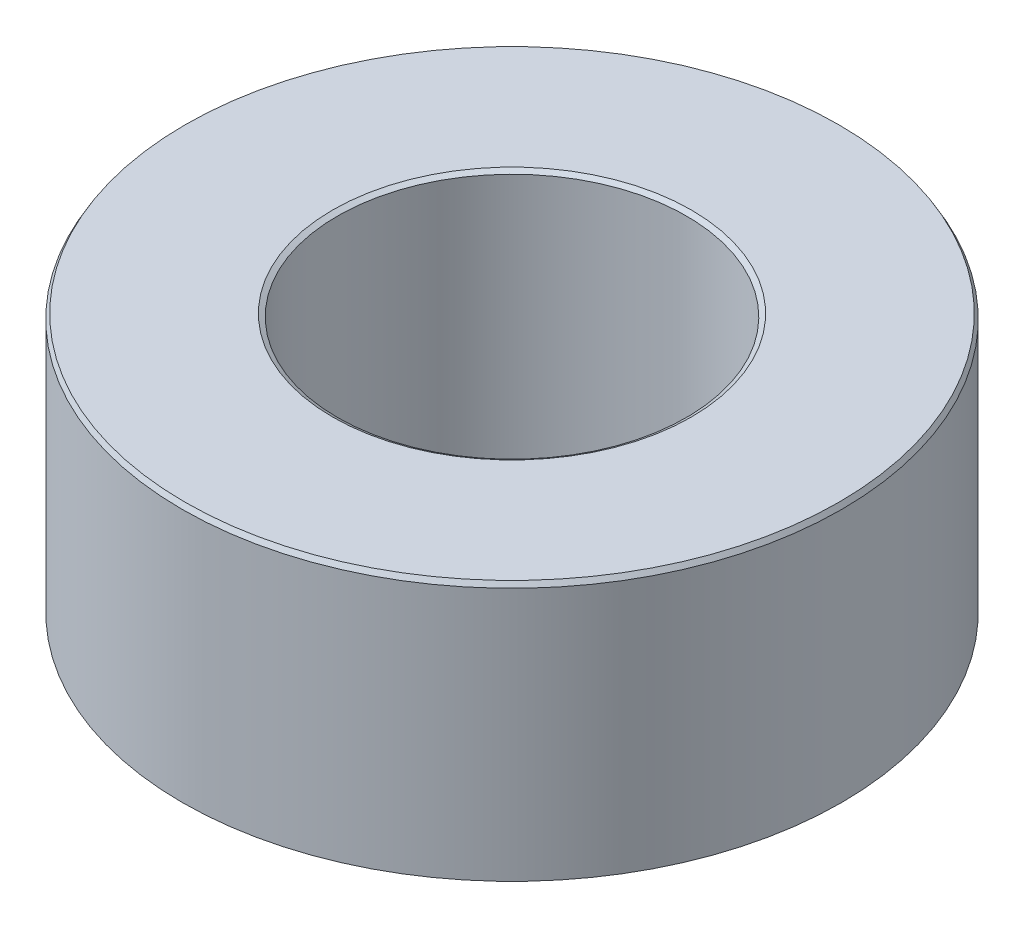
ISO-10303-21;
HEADER;
FILE_DESCRIPTION(('STEP AP214'),'2;1');
FILE_NAME('part.step','',(''),(''),'','','');
FILE_SCHEMA(('AUTOMOTIVE_DESIGN { 1 0 10303 214 1 1 1 1 }'));
ENDSEC;
DATA;
#1=APPLICATION_CONTEXT('core data for automotive mechanical design processes');
#2=APPLICATION_PROTOCOL_DEFINITION('international standard','automotive_design',2000,#1);
#3=PRODUCT_CONTEXT('',#1,'mechanical');
#4=PRODUCT('Part','Part','',(#3));
#5=PRODUCT_RELATED_PRODUCT_CATEGORY('part','',(#4));
#6=PRODUCT_DEFINITION_FORMATION('','',#4);
#7=PRODUCT_DEFINITION_CONTEXT('part definition',#1,'design');
#8=PRODUCT_DEFINITION('design','',#6,#7);
#9=PRODUCT_DEFINITION_SHAPE('','',#8);
#10=(LENGTH_UNIT() NAMED_UNIT(*) SI_UNIT(.MILLI.,.METRE.));
#11=(NAMED_UNIT(*) PLANE_ANGLE_UNIT() SI_UNIT($,.RADIAN.));
#12=(NAMED_UNIT(*) SI_UNIT($,.STERADIAN.) SOLID_ANGLE_UNIT());
#13=UNCERTAINTY_MEASURE_WITH_UNIT(LENGTH_MEASURE(1.E-05),#10,'distance_accuracy_value','');
#14=(GEOMETRIC_REPRESENTATION_CONTEXT(3) GLOBAL_UNCERTAINTY_ASSIGNED_CONTEXT((#13)) GLOBAL_UNIT_ASSIGNED_CONTEXT((#10,
#11,#12)) REPRESENTATION_CONTEXT('',''));
#15=CARTESIAN_POINT('',(0.,0.,0.));
#16=DIRECTION('',(0.,0.,1.));
#17=DIRECTION('',(1.,0.,0.));
#18=AXIS2_PLACEMENT_3D('',#15,#16,#17);
#19=CARTESIAN_POINT('',(0.,39.6510535892631,0.));
#20=DIRECTION('',(0.,-1.,0.));
#21=DIRECTION('',(0.,0.,-1.));
#22=AXIS2_PLACEMENT_3D('',#19,#20,#21);
#23=CYLINDRICAL_SURFACE('',#22,50.);
#24=CARTESIAN_POINT('',(0.,0.422666431278793,0.));
#25=DIRECTION('',(0.,1.,0.));
#26=DIRECTION('',(0.,0.,1.));
#27=AXIS2_PLACEMENT_3D('',#24,#25,#26);
#28=CIRCLE('',#27,50.);
#29=CARTESIAN_POINT('',(0.,0.422666431278793,50.));
#30=VERTEX_POINT('',#29);
#31=EDGE_CURVE('E10',#30,#30,#28,.T.);
#32=ORIENTED_EDGE('',*,*,#31,.T.);
#33=EDGE_LOOP('',(#32));
#34=FACE_BOUND('',#33,.T.);
#35=CARTESIAN_POINT('',(0.,38.9189738556344,0.));
#36=DIRECTION('',(0.,1.,0.));
#37=DIRECTION('',(0.,0.,1.));
#38=AXIS2_PLACEMENT_3D('',#35,#36,#37);
#39=CIRCLE('',#38,50.);
#40=CARTESIAN_POINT('',(0.,38.9189738556344,50.));
#41=VERTEX_POINT('',#40);
#42=EDGE_CURVE('E50',#41,#41,#39,.F.);
#43=ORIENTED_EDGE('',*,*,#42,.T.);
#44=EDGE_LOOP('',(#43));
#45=FACE_BOUND('',#44,.T.);
#46=ADVANCED_FACE('F39',(#34,#45),#23,.T.);
#47=CARTESIAN_POINT('',(0.,39.6510535892631,0.));
#48=DIRECTION('',(0.,1.,0.));
#49=DIRECTION('',(0.,0.,1.));
#50=AXIS2_PLACEMENT_3D('',#47,#48,#49);
#51=PLANE('',#50);
#52=CARTESIAN_POINT('',(0.,39.6510535892631,0.));
#53=DIRECTION('',(0.,1.,0.));
#54=DIRECTION('',(0.,0.,1.));
#55=AXIS2_PLACEMENT_3D('',#52,#53,#54);
#56=CIRCLE('',#55,27.1999728013232);
#57=CARTESIAN_POINT('',(0.,39.6510535892631,27.1999728013232));
#58=VERTEX_POINT('',#57);
#59=EDGE_CURVE('E58',#58,#58,#56,.F.);
#60=ORIENTED_EDGE('',*,*,#59,.T.);
#61=EDGE_LOOP('',(#60));
#62=FACE_BOUND('',#61,.T.);
#63=CARTESIAN_POINT('',(0.,39.6510535892631,0.));
#64=DIRECTION('',(0.,1.,0.));
#65=DIRECTION('',(0.,0.,1.));
#66=AXIS2_PLACEMENT_3D('',#63,#64,#65);
#67=CIRCLE('',#66,49.5773335687212);
#68=CARTESIAN_POINT('',(0.,39.6510535892631,49.5773335687212));
#69=VERTEX_POINT('',#68);
#70=EDGE_CURVE('E61',#69,#69,#67,.T.);
#71=ORIENTED_EDGE('',*,*,#70,.T.);
#72=EDGE_LOOP('',(#71));
#73=FACE_BOUND('',#72,.T.);
#74=ADVANCED_FACE('F88',(#62,#73),#51,.T.);
#75=CARTESIAN_POINT('',(0.,0.,0.));
#76=DIRECTION('',(0.,1.,0.));
#77=DIRECTION('',(0.,0.,1.));
#78=AXIS2_PLACEMENT_3D('',#75,#76,#77);
#79=PLANE('',#78);
#80=CARTESIAN_POINT('',(0.,0.,0.));
#81=DIRECTION('',(0.,1.,0.));
#82=DIRECTION('',(0.,0.,1.));
#83=AXIS2_PLACEMENT_3D('',#80,#81,#82);
#84=CIRCLE('',#83,26.8905594989733);
#85=CARTESIAN_POINT('',(0.,0.,26.8905594989733));
#86=VERTEX_POINT('',#85);
#87=EDGE_CURVE('E51',#86,#86,#84,.T.);
#88=ORIENTED_EDGE('',*,*,#87,.T.);
#89=EDGE_LOOP('',(#88));
#90=FACE_BOUND('',#89,.T.);
#91=CARTESIAN_POINT('',(0.,0.,0.));
#92=DIRECTION('',(0.,1.,0.));
#93=DIRECTION('',(0.,0.,1.));
#94=AXIS2_PLACEMENT_3D('',#91,#92,#93);
#95=CIRCLE('',#94,49.2679202663713);
#96=CARTESIAN_POINT('',(0.,0.,49.2679202663713));
#97=VERTEX_POINT('',#96);
#98=EDGE_CURVE('E54',#97,#97,#95,.F.);
#99=ORIENTED_EDGE('',*,*,#98,.T.);
#100=EDGE_LOOP('',(#99));
#101=FACE_BOUND('',#100,.T.);
#102=ADVANCED_FACE('F83',(#90,#101),#79,.F.);
#103=CARTESIAN_POINT('',(0.,39.6510535892631,0.));
#104=DIRECTION('',(0.,-1.,0.));
#105=DIRECTION('',(0.,0.,-1.));
#106=AXIS2_PLACEMENT_3D('',#103,#104,#105);
#107=CYLINDRICAL_SURFACE('',#106,26.4678930676945);
#108=CARTESIAN_POINT('',(0.,39.2283871579843,0.));
#109=DIRECTION('',(0.,1.,0.));
#110=DIRECTION('',(0.,0.,1.));
#111=AXIS2_PLACEMENT_3D('',#108,#109,#110);
#112=CIRCLE('',#111,26.4678930676945);
#113=CARTESIAN_POINT('',(0.,39.2283871579843,26.4678930676945));
#114=VERTEX_POINT('',#113);
#115=EDGE_CURVE('E67',#114,#114,#112,.T.);
#116=ORIENTED_EDGE('',*,*,#115,.T.);
#117=EDGE_LOOP('',(#116));
#118=FACE_BOUND('',#117,.T.);
#119=CARTESIAN_POINT('',(0.,0.732079733628717,0.));
#120=DIRECTION('',(0.,1.,0.));
#121=DIRECTION('',(0.,0.,1.));
#122=AXIS2_PLACEMENT_3D('',#119,#120,#121);
#123=CIRCLE('',#122,26.4678930676945);
#124=CARTESIAN_POINT('',(0.,0.732079733628717,26.4678930676945));
#125=VERTEX_POINT('',#124);
#126=EDGE_CURVE('E69',#125,#125,#123,.F.);
#127=ORIENTED_EDGE('',*,*,#126,.T.);
#128=EDGE_LOOP('',(#127));
#129=FACE_BOUND('',#128,.T.);
#130=ADVANCED_FACE('F71',(#118,#129),#107,.F.);
#131=CARTESIAN_POINT('',(0.,39.2283871579843,0.));
#132=DIRECTION('',(0.,1.,0.));
#133=DIRECTION('',(0.,0.,1.));
#134=AXIS2_PLACEMENT_3D('',#131,#132,#133);
#135=CONICAL_SURFACE('',#134,26.4678930676945,1.04719755119659);
#136=ORIENTED_EDGE('',*,*,#59,.F.);
#137=EDGE_LOOP('',(#136));
#138=FACE_BOUND('',#137,.T.);
#139=ORIENTED_EDGE('',*,*,#115,.F.);
#140=EDGE_LOOP('',(#139));
#141=FACE_BOUND('',#140,.T.);
#142=ADVANCED_FACE('F77',(#138,#141),#135,.F.);
#143=CARTESIAN_POINT('',(0.,0.,0.));
#144=DIRECTION('',(0.,-1.,0.));
#145=DIRECTION('',(0.,0.,-1.));
#146=AXIS2_PLACEMENT_3D('',#143,#144,#145);
#147=CONICAL_SURFACE('',#146,26.8905594989733,0.523598775598292);
#148=ORIENTED_EDGE('',*,*,#126,.F.);
#149=EDGE_LOOP('',(#148));
#150=FACE_BOUND('',#149,.T.);
#151=ORIENTED_EDGE('',*,*,#87,.F.);
#152=EDGE_LOOP('',(#151));
#153=FACE_BOUND('',#152,.T.);
#154=ADVANCED_FACE('F73',(#150,#153),#147,.F.);
#155=CARTESIAN_POINT('',(0.,0.422666431278793,0.));
#156=DIRECTION('',(0.,1.,0.));
#157=DIRECTION('',(0.,0.,1.));
#158=AXIS2_PLACEMENT_3D('',#155,#156,#157);
#159=CONICAL_SURFACE('',#158,50.,1.04719755119662);
#160=ORIENTED_EDGE('',*,*,#98,.F.);
#161=EDGE_LOOP('',(#160));
#162=FACE_BOUND('',#161,.T.);
#163=ORIENTED_EDGE('',*,*,#31,.F.);
#164=EDGE_LOOP('',(#163));
#165=FACE_BOUND('',#164,.T.);
#166=ADVANCED_FACE('F76',(#162,#165),#159,.T.);
#167=CARTESIAN_POINT('',(0.,39.6510535892631,0.));
#168=DIRECTION('',(0.,-1.,0.));
#169=DIRECTION('',(0.,0.,-1.));
#170=AXIS2_PLACEMENT_3D('',#167,#168,#169);
#171=CONICAL_SURFACE('',#170,49.5773335687212,0.523598775598284);
#172=ORIENTED_EDGE('',*,*,#42,.F.);
#173=EDGE_LOOP('',(#172));
#174=FACE_BOUND('',#173,.T.);
#175=ORIENTED_EDGE('',*,*,#70,.F.);
#176=EDGE_LOOP('',(#175));
#177=FACE_BOUND('',#176,.T.);
#178=ADVANCED_FACE('F45',(#174,#177),#171,.T.);
#179=CLOSED_SHELL('',(#46,#74,#102,#130,#142,#154,#166,#178));
#180=MANIFOLD_SOLID_BREP('B2',#179);
#181=ADVANCED_BREP_SHAPE_REPRESENTATION('',(#18,#180),#14);
#182=SHAPE_DEFINITION_REPRESENTATION(#9,#181);
ENDSEC;
END-ISO-10303-21;
